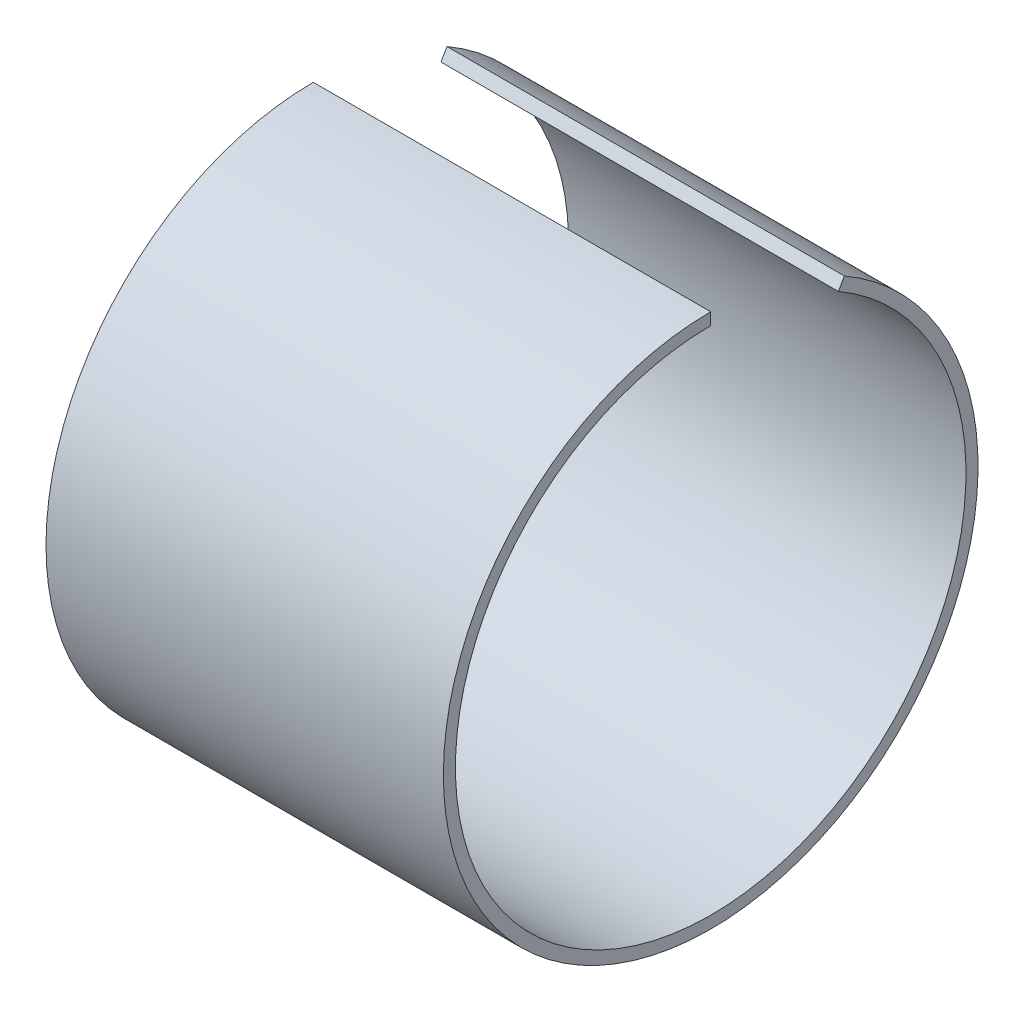
ISO-10303-21;
HEADER;
FILE_DESCRIPTION(('STEP AP214'),'2;1');
FILE_NAME('part.step','',(''),(''),'','','');
FILE_SCHEMA(('AUTOMOTIVE_DESIGN { 1 0 10303 214 1 1 1 1 }'));
ENDSEC;
DATA;
#1=APPLICATION_CONTEXT('core data for automotive mechanical design processes');
#2=APPLICATION_PROTOCOL_DEFINITION('international standard','automotive_design',2000,#1);
#3=PRODUCT_CONTEXT('',#1,'mechanical');
#4=PRODUCT('Part','Part','',(#3));
#5=PRODUCT_RELATED_PRODUCT_CATEGORY('part','',(#4));
#6=PRODUCT_DEFINITION_FORMATION('','',#4);
#7=PRODUCT_DEFINITION_CONTEXT('part definition',#1,'design');
#8=PRODUCT_DEFINITION('design','',#6,#7);
#9=PRODUCT_DEFINITION_SHAPE('','',#8);
#10=(LENGTH_UNIT() NAMED_UNIT(*) SI_UNIT(.MILLI.,.METRE.));
#11=(NAMED_UNIT(*) PLANE_ANGLE_UNIT() SI_UNIT($,.RADIAN.));
#12=(NAMED_UNIT(*) SI_UNIT($,.STERADIAN.) SOLID_ANGLE_UNIT());
#13=UNCERTAINTY_MEASURE_WITH_UNIT(LENGTH_MEASURE(1.E-05),#10,'distance_accuracy_value','');
#14=(GEOMETRIC_REPRESENTATION_CONTEXT(3) GLOBAL_UNCERTAINTY_ASSIGNED_CONTEXT((#13)) GLOBAL_UNIT_ASSIGNED_CONTEXT((#10,
#11,#12)) REPRESENTATION_CONTEXT('',''));
#15=CARTESIAN_POINT('',(0.,0.,0.));
#16=DIRECTION('',(0.,0.,1.));
#17=DIRECTION('',(1.,0.,0.));
#18=AXIS2_PLACEMENT_3D('',#15,#16,#17);
#19=CARTESIAN_POINT('',(0.,18.3597385602302,-10.5999999999998));
#20=DIRECTION('',(1.,0.,0.));
#21=DIRECTION('',(0.,0.,-1.));
#22=AXIS2_PLACEMENT_3D('',#19,#20,#21);
#23=PLANE('',#22);
#24=CARTESIAN_POINT('',(0.,0.,0.));
#25=DIRECTION('',(-1.,0.,0.));
#26=DIRECTION('',(0.,0.,1.));
#27=AXIS2_PLACEMENT_3D('',#24,#25,#26);
#28=CIRCLE('',#27,22.2);
#29=CARTESIAN_POINT('',(0.,19.2257639640147,-11.0999999999998));
#30=VERTEX_POINT('',#29);
#31=CARTESIAN_POINT('',(0.,22.2,0.));
#32=VERTEX_POINT('',#31);
#33=EDGE_CURVE('E11',#30,#32,#28,.T.);
#34=ORIENTED_EDGE('',*,*,#33,.T.);
#35=DIRECTION('',(0.,-1.,0.));
#36=VECTOR('',#35,1.);
#37=CARTESIAN_POINT('',(0.,21.2,0.));
#38=LINE('',#37,#36);
#39=CARTESIAN_POINT('',(0.,21.2,0.));
#40=VERTEX_POINT('',#39);
#41=EDGE_CURVE('E90',#32,#40,#38,.T.);
#42=ORIENTED_EDGE('',*,*,#41,.T.);
#43=CARTESIAN_POINT('',(0.,0.,0.));
#44=DIRECTION('',(-1.,0.,0.));
#45=DIRECTION('',(0.,0.,1.));
#46=AXIS2_PLACEMENT_3D('',#43,#44,#45);
#47=CIRCLE('',#46,21.2);
#48=CARTESIAN_POINT('',(0.,18.3597385602302,-10.5999999999998));
#49=VERTEX_POINT('',#48);
#50=EDGE_CURVE('E72',#49,#40,#47,.T.);
#51=ORIENTED_EDGE('',*,*,#50,.F.);
#52=DIRECTION('',(0.,-0.866025403784445,0.499999999999989));
#53=VECTOR('',#52,1.);
#54=CARTESIAN_POINT('',(0.,18.3597385602302,-10.5999999999998));
#55=LINE('',#54,#53);
#56=EDGE_CURVE('E98',#30,#49,#55,.T.);
#57=ORIENTED_EDGE('',*,*,#56,.F.);
#58=EDGE_LOOP('',(#34,#42,#51,#57));
#59=FACE_BOUND('',#58,.T.);
#60=ADVANCED_FACE('F32',(#59),#23,.F.);
#61=CARTESIAN_POINT('',(0.,0.,0.));
#62=DIRECTION('',(-1.,0.,0.));
#63=DIRECTION('',(0.,0.,1.));
#64=AXIS2_PLACEMENT_3D('',#61,#62,#63);
#65=CYLINDRICAL_SURFACE('',#64,22.2);
#66=CARTESIAN_POINT('',(33.,0.,0.));
#67=DIRECTION('',(-1.,0.,0.));
#68=DIRECTION('',(0.,0.,1.));
#69=AXIS2_PLACEMENT_3D('',#66,#67,#68);
#70=CIRCLE('',#69,22.2);
#71=CARTESIAN_POINT('',(33.,19.2257639640147,-11.0999999999998));
#72=VERTEX_POINT('',#71);
#73=CARTESIAN_POINT('',(33.,22.2,0.));
#74=VERTEX_POINT('',#73);
#75=EDGE_CURVE('E40',#72,#74,#70,.T.);
#76=ORIENTED_EDGE('',*,*,#75,.T.);
#77=DIRECTION('',(-1.,0.,0.));
#78=VECTOR('',#77,1.);
#79=CARTESIAN_POINT('',(0.,22.2,0.));
#80=LINE('',#79,#78);
#81=EDGE_CURVE('E96',#74,#32,#80,.T.);
#82=ORIENTED_EDGE('',*,*,#81,.T.);
#83=ORIENTED_EDGE('',*,*,#33,.F.);
#84=DIRECTION('',(-1.,0.,0.));
#85=VECTOR('',#84,1.);
#86=CARTESIAN_POINT('',(0.,19.2257639640147,-11.0999999999998));
#87=LINE('',#86,#85);
#88=EDGE_CURVE('E84',#72,#30,#87,.T.);
#89=ORIENTED_EDGE('',*,*,#88,.F.);
#90=EDGE_LOOP('',(#76,#82,#83,#89));
#91=FACE_BOUND('',#90,.T.);
#92=ADVANCED_FACE('F34',(#91),#65,.T.);
#93=CARTESIAN_POINT('',(33.,19.2257639640147,-11.0999999999998));
#94=DIRECTION('',(-1.,0.,0.));
#95=DIRECTION('',(0.,0.,1.));
#96=AXIS2_PLACEMENT_3D('',#93,#94,#95);
#97=PLANE('',#96);
#98=CARTESIAN_POINT('',(33.,0.,0.));
#99=DIRECTION('',(-1.,0.,0.));
#100=DIRECTION('',(0.,0.,1.));
#101=AXIS2_PLACEMENT_3D('',#98,#99,#100);
#102=CIRCLE('',#101,21.2);
#103=CARTESIAN_POINT('',(33.,18.3597385602302,-10.5999999999998));
#104=VERTEX_POINT('',#103);
#105=CARTESIAN_POINT('',(33.,21.2,0.));
#106=VERTEX_POINT('',#105);
#107=EDGE_CURVE('E83',#104,#106,#102,.T.);
#108=ORIENTED_EDGE('',*,*,#107,.T.);
#109=DIRECTION('',(0.,1.,0.));
#110=VECTOR('',#109,1.);
#111=CARTESIAN_POINT('',(33.,22.2,0.));
#112=LINE('',#111,#110);
#113=EDGE_CURVE('E91',#106,#74,#112,.T.);
#114=ORIENTED_EDGE('',*,*,#113,.T.);
#115=ORIENTED_EDGE('',*,*,#75,.F.);
#116=DIRECTION('',(0.,0.866025403784445,-0.499999999999989));
#117=VECTOR('',#116,1.);
#118=CARTESIAN_POINT('',(33.,19.2257639640147,-11.0999999999998));
#119=LINE('',#118,#117);
#120=EDGE_CURVE('E101',#104,#72,#119,.T.);
#121=ORIENTED_EDGE('',*,*,#120,.F.);
#122=EDGE_LOOP('',(#108,#114,#115,#121));
#123=FACE_BOUND('',#122,.T.);
#124=ADVANCED_FACE('F104',(#123),#97,.F.);
#125=CARTESIAN_POINT('',(0.,0.,0.));
#126=DIRECTION('',(-1.,0.,0.));
#127=DIRECTION('',(0.,0.,1.));
#128=AXIS2_PLACEMENT_3D('',#125,#126,#127);
#129=CYLINDRICAL_SURFACE('',#128,21.2);
#130=DIRECTION('',(1.,0.,0.));
#131=VECTOR('',#130,1.);
#132=CARTESIAN_POINT('',(0.,18.3597385602302,-10.5999999999998));
#133=LINE('',#132,#131);
#134=EDGE_CURVE('E78',#49,#104,#133,.T.);
#135=ORIENTED_EDGE('',*,*,#134,.F.);
#136=ORIENTED_EDGE('',*,*,#50,.T.);
#137=DIRECTION('',(1.,0.,0.));
#138=VECTOR('',#137,1.);
#139=CARTESIAN_POINT('',(0.,21.2,0.));
#140=LINE('',#139,#138);
#141=EDGE_CURVE('E75',#40,#106,#140,.T.);
#142=ORIENTED_EDGE('',*,*,#141,.T.);
#143=ORIENTED_EDGE('',*,*,#107,.F.);
#144=EDGE_LOOP('',(#135,#136,#142,#143));
#145=FACE_BOUND('',#144,.T.);
#146=ADVANCED_FACE('F74',(#145),#129,.F.);
#147=CARTESIAN_POINT('',(0.,0.,0.));
#148=DIRECTION('',(0.,-0.499999999999989,-0.866025403784445));
#149=DIRECTION('',(-1.,0.,0.));
#150=AXIS2_PLACEMENT_3D('',#147,#148,#149);
#151=PLANE('',#150);
#152=ORIENTED_EDGE('',*,*,#56,.T.);
#153=ORIENTED_EDGE('',*,*,#134,.T.);
#154=ORIENTED_EDGE('',*,*,#120,.T.);
#155=ORIENTED_EDGE('',*,*,#88,.T.);
#156=EDGE_LOOP('',(#152,#153,#154,#155));
#157=FACE_BOUND('',#156,.T.);
#158=ADVANCED_FACE('F106',(#157),#151,.F.);
#159=CARTESIAN_POINT('',(0.,0.,0.));
#160=DIRECTION('',(0.,0.,-1.));
#161=DIRECTION('',(-1.,0.,0.));
#162=AXIS2_PLACEMENT_3D('',#159,#160,#161);
#163=PLANE('',#162);
#164=ORIENTED_EDGE('',*,*,#41,.F.);
#165=ORIENTED_EDGE('',*,*,#81,.F.);
#166=ORIENTED_EDGE('',*,*,#113,.F.);
#167=ORIENTED_EDGE('',*,*,#141,.F.);
#168=EDGE_LOOP('',(#164,#165,#166,#167));
#169=FACE_BOUND('',#168,.T.);
#170=ADVANCED_FACE('F88',(#169),#163,.T.);
#171=CLOSED_SHELL('',(#60,#92,#124,#146,#158,#170));
#172=MANIFOLD_SOLID_BREP('B2',#171);
#173=ADVANCED_BREP_SHAPE_REPRESENTATION('',(#18,#172),#14);
#174=SHAPE_DEFINITION_REPRESENTATION(#9,#173);
ENDSEC;
END-ISO-10303-21;
